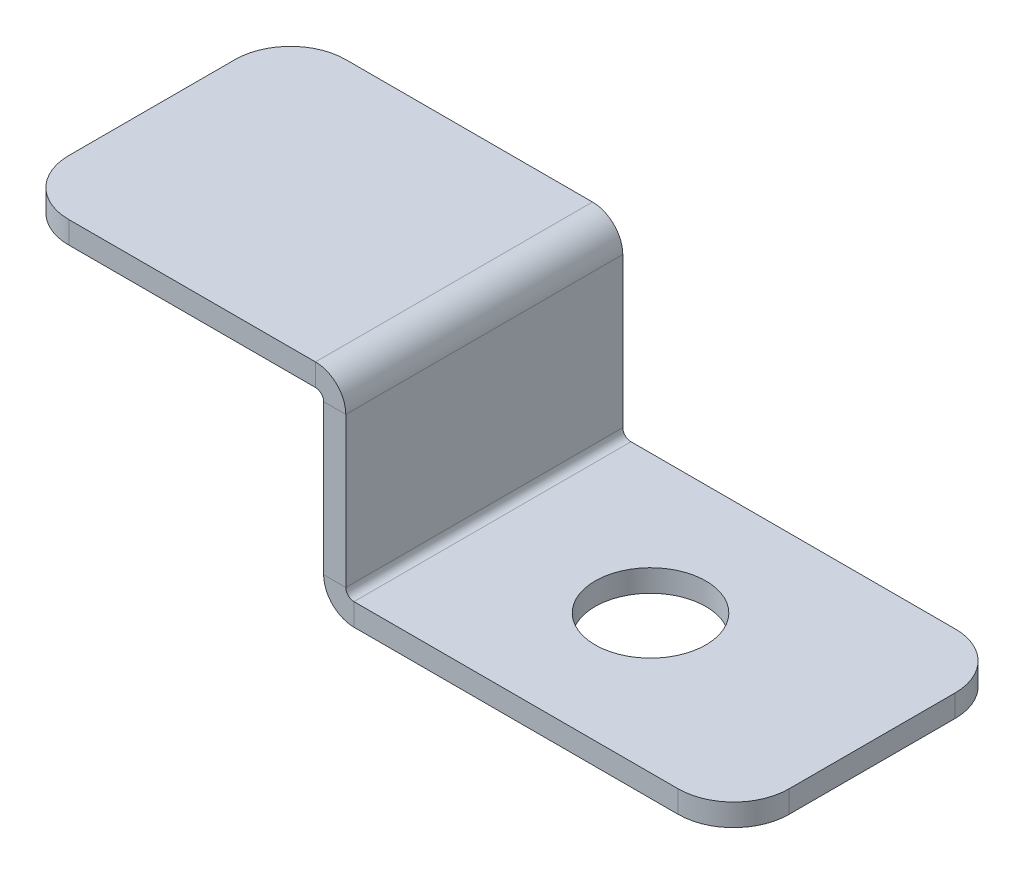
ISO-10303-21;
HEADER;
FILE_DESCRIPTION(('STEP AP214'),'2;1');
FILE_NAME('part.step','',(''),(''),'','','');
FILE_SCHEMA(('AUTOMOTIVE_DESIGN { 1 0 10303 214 1 1 1 1 }'));
ENDSEC;
DATA;
#1=APPLICATION_CONTEXT('core data for automotive mechanical design processes');
#2=APPLICATION_PROTOCOL_DEFINITION('international standard','automotive_design',2000,#1);
#3=PRODUCT_CONTEXT('',#1,'mechanical');
#4=PRODUCT('Part','Part','',(#3));
#5=PRODUCT_RELATED_PRODUCT_CATEGORY('part','',(#4));
#6=PRODUCT_DEFINITION_FORMATION('','',#4);
#7=PRODUCT_DEFINITION_CONTEXT('part definition',#1,'design');
#8=PRODUCT_DEFINITION('design','',#6,#7);
#9=PRODUCT_DEFINITION_SHAPE('','',#8);
#10=(LENGTH_UNIT() NAMED_UNIT(*) SI_UNIT(.MILLI.,.METRE.));
#11=(NAMED_UNIT(*) PLANE_ANGLE_UNIT() SI_UNIT($,.RADIAN.));
#12=(NAMED_UNIT(*) SI_UNIT($,.STERADIAN.) SOLID_ANGLE_UNIT());
#13=UNCERTAINTY_MEASURE_WITH_UNIT(LENGTH_MEASURE(1.E-05),#10,'distance_accuracy_value','');
#14=(GEOMETRIC_REPRESENTATION_CONTEXT(3) GLOBAL_UNCERTAINTY_ASSIGNED_CONTEXT((#13)) GLOBAL_UNIT_ASSIGNED_CONTEXT((#10,
#11,#12)) REPRESENTATION_CONTEXT('',''));
#15=CARTESIAN_POINT('',(0.,0.,0.));
#16=DIRECTION('',(0.,0.,1.));
#17=DIRECTION('',(1.,0.,0.));
#18=AXIS2_PLACEMENT_3D('',#15,#16,#17);
#19=CARTESIAN_POINT('',(30.,-2.7366,12.5));
#20=DIRECTION('',(0.,0.,1.));
#21=DIRECTION('',(1.,0.,0.));
#22=AXIS2_PLACEMENT_3D('',#19,#20,#21);
#23=PLANE('',#22);
#24=DIRECTION('',(-1.,0.,0.));
#25=VECTOR('',#24,1.);
#26=CARTESIAN_POINT('',(30.,-2.7366,12.5));
#27=LINE('',#26,#25);
#28=CARTESIAN_POINT('',(30.,-2.7366,12.5));
#29=VERTEX_POINT('',#28);
#30=CARTESIAN_POINT('',(28.,-2.7366,12.5));
#31=VERTEX_POINT('',#30);
#32=EDGE_CURVE('E272',#29,#31,#27,.T.);
#33=ORIENTED_EDGE('',*,*,#32,.F.);
#34=CARTESIAN_POINT('',(27.2634,-2.7366,12.5));
#35=DIRECTION('',(0.,0.,1.));
#36=DIRECTION('',(1.,0.,0.));
#37=AXIS2_PLACEMENT_3D('',#34,#35,#36);
#38=CIRCLE('',#37,2.7366);
#39=CARTESIAN_POINT('',(27.2634,0.,12.5));
#40=VERTEX_POINT('',#39);
#41=EDGE_CURVE('E188',#40,#29,#38,.F.);
#42=ORIENTED_EDGE('',*,*,#41,.F.);
#43=DIRECTION('',(0.,1.,0.));
#44=VECTOR('',#43,1.);
#45=CARTESIAN_POINT('',(27.2634,-2.,12.5));
#46=LINE('',#45,#44);
#47=CARTESIAN_POINT('',(27.2634,-2.,12.5));
#48=VERTEX_POINT('',#47);
#49=EDGE_CURVE('E269',#48,#40,#46,.T.);
#50=ORIENTED_EDGE('',*,*,#49,.F.);
#51=CARTESIAN_POINT('',(27.2634,-2.7366,12.5));
#52=DIRECTION('',(0.,0.,1.));
#53=DIRECTION('',(1.,0.,0.));
#54=AXIS2_PLACEMENT_3D('',#51,#52,#53);
#55=CIRCLE('',#54,0.7366);
#56=EDGE_CURVE('E198',#48,#31,#55,.F.);
#57=ORIENTED_EDGE('',*,*,#56,.T.);
#58=EDGE_LOOP('',(#33,#42,#50,#57));
#59=FACE_BOUND('',#58,.T.);
#60=ADVANCED_FACE('F39',(#59),#23,.T.);
#61=CARTESIAN_POINT('',(27.2634,-2.,12.5));
#62=DIRECTION('',(0.,0.,1.));
#63=DIRECTION('',(1.,0.,0.));
#64=AXIS2_PLACEMENT_3D('',#61,#62,#63);
#65=PLANE('',#64);
#66=DIRECTION('',(0.,-1.,0.));
#67=VECTOR('',#66,1.);
#68=CARTESIAN_POINT('',(30.,0.,12.5));
#69=LINE('',#68,#67);
#70=CARTESIAN_POINT('',(30.,-16.2634,12.5));
#71=VERTEX_POINT('',#70);
#72=EDGE_CURVE('E186',#29,#71,#69,.T.);
#73=ORIENTED_EDGE('',*,*,#72,.F.);
#74=ORIENTED_EDGE('',*,*,#32,.T.);
#75=DIRECTION('',(0.,1.,0.));
#76=VECTOR('',#75,1.);
#77=CARTESIAN_POINT('',(28.,0.,12.5));
#78=LINE('',#77,#76);
#79=CARTESIAN_POINT('',(28.,-16.2634,12.5));
#80=VERTEX_POINT('',#79);
#81=EDGE_CURVE('E201',#31,#80,#78,.F.);
#82=ORIENTED_EDGE('',*,*,#81,.T.);
#83=DIRECTION('',(1.,0.,0.));
#84=VECTOR('',#83,1.);
#85=CARTESIAN_POINT('',(28.,-16.2634,12.5));
#86=LINE('',#85,#84);
#87=EDGE_CURVE('E166',#80,#71,#86,.T.);
#88=ORIENTED_EDGE('',*,*,#87,.T.);
#89=EDGE_LOOP('',(#73,#74,#82,#88));
#90=FACE_BOUND('',#89,.T.);
#91=ADVANCED_FACE('F359',(#90),#65,.T.);
#92=CARTESIAN_POINT('',(27.2634,0.,-12.5));
#93=DIRECTION('',(0.,0.,-1.));
#94=DIRECTION('',(-1.,0.,0.));
#95=AXIS2_PLACEMENT_3D('',#92,#93,#94);
#96=PLANE('',#95);
#97=DIRECTION('',(0.,-1.,0.));
#98=VECTOR('',#97,1.);
#99=CARTESIAN_POINT('',(27.2634,0.,-12.5));
#100=LINE('',#99,#98);
#101=CARTESIAN_POINT('',(27.2634,0.,-12.5));
#102=VERTEX_POINT('',#101);
#103=CARTESIAN_POINT('',(27.2634,-2.,-12.5));
#104=VERTEX_POINT('',#103);
#105=EDGE_CURVE('E266',#102,#104,#100,.T.);
#106=ORIENTED_EDGE('',*,*,#105,.F.);
#107=CARTESIAN_POINT('',(27.2634,-2.7366,-12.5));
#108=DIRECTION('',(0.,0.,1.));
#109=DIRECTION('',(1.,0.,0.));
#110=AXIS2_PLACEMENT_3D('',#107,#108,#109);
#111=CIRCLE('',#110,2.7366);
#112=CARTESIAN_POINT('',(30.,-2.7366,-12.5));
#113=VERTEX_POINT('',#112);
#114=EDGE_CURVE('E216',#102,#113,#111,.F.);
#115=ORIENTED_EDGE('',*,*,#114,.T.);
#116=DIRECTION('',(1.,0.,0.));
#117=VECTOR('',#116,1.);
#118=CARTESIAN_POINT('',(28.,-2.7366,-12.5));
#119=LINE('',#118,#117);
#120=CARTESIAN_POINT('',(28.,-2.7366,-12.5));
#121=VERTEX_POINT('',#120);
#122=EDGE_CURVE('E165',#121,#113,#119,.T.);
#123=ORIENTED_EDGE('',*,*,#122,.F.);
#124=CARTESIAN_POINT('',(27.2634,-2.7366,-12.5));
#125=DIRECTION('',(0.,0.,1.));
#126=DIRECTION('',(1.,0.,0.));
#127=AXIS2_PLACEMENT_3D('',#124,#125,#126);
#128=CIRCLE('',#127,0.7366);
#129=EDGE_CURVE('E223',#104,#121,#128,.F.);
#130=ORIENTED_EDGE('',*,*,#129,.F.);
#131=EDGE_LOOP('',(#106,#115,#123,#130));
#132=FACE_BOUND('',#131,.T.);
#133=ADVANCED_FACE('F322',(#132),#96,.T.);
#134=CARTESIAN_POINT('',(28.,-2.7366,-12.5));
#135=DIRECTION('',(0.,0.,-1.));
#136=DIRECTION('',(-1.,0.,0.));
#137=AXIS2_PLACEMENT_3D('',#134,#135,#136);
#138=PLANE('',#137);
#139=DIRECTION('',(1.,0.,0.));
#140=VECTOR('',#139,1.);
#141=CARTESIAN_POINT('',(0.,-2.,-12.5));
#142=LINE('',#141,#140);
#143=CARTESIAN_POINT('',(5.,-2.,-12.5));
#144=VERTEX_POINT('',#143);
#145=EDGE_CURVE('E221',#144,#104,#142,.T.);
#146=ORIENTED_EDGE('',*,*,#145,.F.);
#147=DIRECTION('',(0.,1.,0.));
#148=VECTOR('',#147,1.);
#149=CARTESIAN_POINT('',(5.,-2.7366,-12.5));
#150=LINE('',#149,#148);
#151=CARTESIAN_POINT('',(5.,0.,-12.5));
#152=VERTEX_POINT('',#151);
#153=EDGE_CURVE('E47',#144,#152,#150,.T.);
#154=ORIENTED_EDGE('',*,*,#153,.T.);
#155=DIRECTION('',(1.,0.,0.));
#156=VECTOR('',#155,1.);
#157=CARTESIAN_POINT('',(0.,0.,-12.5));
#158=LINE('',#157,#156);
#159=EDGE_CURVE('E219',#152,#102,#158,.T.);
#160=ORIENTED_EDGE('',*,*,#159,.T.);
#161=ORIENTED_EDGE('',*,*,#105,.T.);
#162=EDGE_LOOP('',(#146,#154,#160,#161));
#163=FACE_BOUND('',#162,.T.);
#164=ADVANCED_FACE('F306',(#163),#138,.T.);
#165=CARTESIAN_POINT('',(30.7366,-17.,12.5));
#166=DIRECTION('',(0.,0.,1.));
#167=DIRECTION('',(1.,0.,0.));
#168=AXIS2_PLACEMENT_3D('',#165,#166,#167);
#169=PLANE('',#168);
#170=DIRECTION('',(0.,-1.,0.));
#171=VECTOR('',#170,1.);
#172=CARTESIAN_POINT('',(30.7366,-17.,12.5));
#173=LINE('',#172,#171);
#174=CARTESIAN_POINT('',(30.7366,-17.,12.5));
#175=VERTEX_POINT('',#174);
#176=CARTESIAN_POINT('',(30.7366,-19.,12.5));
#177=VERTEX_POINT('',#176);
#178=EDGE_CURVE('E156',#175,#177,#173,.T.);
#179=ORIENTED_EDGE('',*,*,#178,.F.);
#180=CARTESIAN_POINT('',(30.7366,-16.2634,12.5));
#181=DIRECTION('',(0.,0.,-1.));
#182=DIRECTION('',(-1.,0.,0.));
#183=AXIS2_PLACEMENT_3D('',#180,#181,#182);
#184=CIRCLE('',#183,0.7366);
#185=EDGE_CURVE('E160',#71,#175,#184,.F.);
#186=ORIENTED_EDGE('',*,*,#185,.F.);
#187=ORIENTED_EDGE('',*,*,#87,.F.);
#188=CARTESIAN_POINT('',(30.7366,-16.2634,12.5));
#189=DIRECTION('',(0.,0.,1.));
#190=DIRECTION('',(1.,0.,0.));
#191=AXIS2_PLACEMENT_3D('',#188,#189,#190);
#192=CIRCLE('',#191,2.7366);
#193=EDGE_CURVE('E163',#80,#177,#192,.T.);
#194=ORIENTED_EDGE('',*,*,#193,.T.);
#195=EDGE_LOOP('',(#179,#186,#187,#194));
#196=FACE_BOUND('',#195,.T.);
#197=ADVANCED_FACE('F158',(#196),#169,.T.);
#198=CARTESIAN_POINT('',(28.,-16.2634,12.5));
#199=DIRECTION('',(0.,0.,1.));
#200=DIRECTION('',(1.,0.,0.));
#201=AXIS2_PLACEMENT_3D('',#198,#199,#200);
#202=PLANE('',#201);
#203=DIRECTION('',(1.,0.,0.));
#204=VECTOR('',#203,1.);
#205=CARTESIAN_POINT('',(30.,-19.,12.5));
#206=LINE('',#205,#204);
#207=CARTESIAN_POINT('',(60.,-19.,12.5));
#208=VERTEX_POINT('',#207);
#209=EDGE_CURVE('E181',#177,#208,#206,.T.);
#210=ORIENTED_EDGE('',*,*,#209,.T.);
#211=DIRECTION('',(0.,-1.,0.));
#212=VECTOR('',#211,1.);
#213=CARTESIAN_POINT('',(60.,-16.2634,12.5));
#214=LINE('',#213,#212);
#215=CARTESIAN_POINT('',(60.,-17.,12.5));
#216=VERTEX_POINT('',#215);
#217=EDGE_CURVE('E62',#208,#216,#214,.F.);
#218=ORIENTED_EDGE('',*,*,#217,.T.);
#219=DIRECTION('',(1.,0.,0.));
#220=VECTOR('',#219,1.);
#221=CARTESIAN_POINT('',(30.,-17.,12.5));
#222=LINE('',#221,#220);
#223=EDGE_CURVE('E171',#175,#216,#222,.T.);
#224=ORIENTED_EDGE('',*,*,#223,.F.);
#225=ORIENTED_EDGE('',*,*,#178,.T.);
#226=EDGE_LOOP('',(#210,#218,#224,#225));
#227=FACE_BOUND('',#226,.T.);
#228=ADVANCED_FACE('F180',(#227),#202,.T.);
#229=CARTESIAN_POINT('',(30.,-16.2634,-12.5));
#230=DIRECTION('',(0.,0.,-1.));
#231=DIRECTION('',(-1.,0.,0.));
#232=AXIS2_PLACEMENT_3D('',#229,#230,#231);
#233=PLANE('',#232);
#234=DIRECTION('',(-1.,0.,0.));
#235=VECTOR('',#234,1.);
#236=CARTESIAN_POINT('',(30.,-16.2634,-12.5));
#237=LINE('',#236,#235);
#238=CARTESIAN_POINT('',(30.,-16.2634,-12.5));
#239=VERTEX_POINT('',#238);
#240=CARTESIAN_POINT('',(28.,-16.2634,-12.5));
#241=VERTEX_POINT('',#240);
#242=EDGE_CURVE('E262',#239,#241,#237,.T.);
#243=ORIENTED_EDGE('',*,*,#242,.F.);
#244=CARTESIAN_POINT('',(30.7366,-16.2634,-12.5));
#245=DIRECTION('',(0.,0.,-1.));
#246=DIRECTION('',(-1.,0.,0.));
#247=AXIS2_PLACEMENT_3D('',#244,#245,#246);
#248=CIRCLE('',#247,0.7366);
#249=CARTESIAN_POINT('',(30.7366,-17.,-12.5));
#250=VERTEX_POINT('',#249);
#251=EDGE_CURVE('E211',#239,#250,#248,.F.);
#252=ORIENTED_EDGE('',*,*,#251,.T.);
#253=DIRECTION('',(0.,1.,0.));
#254=VECTOR('',#253,1.);
#255=CARTESIAN_POINT('',(30.7366,-19.,-12.5));
#256=LINE('',#255,#254);
#257=CARTESIAN_POINT('',(30.7366,-19.,-12.5));
#258=VERTEX_POINT('',#257);
#259=EDGE_CURVE('E260',#258,#250,#256,.T.);
#260=ORIENTED_EDGE('',*,*,#259,.F.);
#261=CARTESIAN_POINT('',(30.7366,-16.2634,-12.5));
#262=DIRECTION('',(0.,0.,1.));
#263=DIRECTION('',(1.,0.,0.));
#264=AXIS2_PLACEMENT_3D('',#261,#262,#263);
#265=CIRCLE('',#264,2.7366);
#266=EDGE_CURVE('E229',#241,#258,#265,.T.);
#267=ORIENTED_EDGE('',*,*,#266,.F.);
#268=EDGE_LOOP('',(#243,#252,#260,#267));
#269=FACE_BOUND('',#268,.T.);
#270=ADVANCED_FACE('F375',(#269),#233,.T.);
#271=CARTESIAN_POINT('',(30.7366,-19.,-12.5));
#272=DIRECTION('',(0.,0.,-1.));
#273=DIRECTION('',(-1.,0.,0.));
#274=AXIS2_PLACEMENT_3D('',#271,#272,#273);
#275=PLANE('',#274);
#276=DIRECTION('',(0.,-1.,0.));
#277=VECTOR('',#276,1.);
#278=CARTESIAN_POINT('',(30.,0.,-12.5));
#279=LINE('',#278,#277);
#280=EDGE_CURVE('E213',#113,#239,#279,.T.);
#281=ORIENTED_EDGE('',*,*,#280,.T.);
#282=ORIENTED_EDGE('',*,*,#242,.T.);
#283=DIRECTION('',(0.,1.,0.));
#284=VECTOR('',#283,1.);
#285=CARTESIAN_POINT('',(28.,0.,-12.5));
#286=LINE('',#285,#284);
#287=EDGE_CURVE('E226',#121,#241,#286,.F.);
#288=ORIENTED_EDGE('',*,*,#287,.F.);
#289=ORIENTED_EDGE('',*,*,#122,.T.);
#290=EDGE_LOOP('',(#281,#282,#288,#289));
#291=FACE_BOUND('',#290,.T.);
#292=ADVANCED_FACE('F378',(#291),#275,.T.);
#293=CARTESIAN_POINT('',(30.,-19.,12.5));
#294=DIRECTION('',(0.,1.,0.));
#295=DIRECTION('',(0.,0.,1.));
#296=AXIS2_PLACEMENT_3D('',#293,#294,#295);
#297=PLANE('',#296);
#298=CARTESIAN_POINT('',(45.,-19.,0.));
#299=DIRECTION('',(0.,1.,0.));
#300=DIRECTION('',(0.,0.,1.));
#301=AXIS2_PLACEMENT_3D('',#298,#299,#300);
#302=CIRCLE('',#301,5.);
#303=CARTESIAN_POINT('',(45.,-19.,5.));
#304=VERTEX_POINT('',#303);
#305=EDGE_CURVE('E209',#304,#304,#302,.T.);
#306=ORIENTED_EDGE('',*,*,#305,.T.);
#307=EDGE_LOOP('',(#306));
#308=FACE_BOUND('',#307,.T.);
#309=DIRECTION('',(0.,0.,-1.));
#310=VECTOR('',#309,1.);
#311=CARTESIAN_POINT('',(65.,-19.,12.5));
#312=LINE('',#311,#310);
#313=CARTESIAN_POINT('',(65.,-19.,7.5));
#314=VERTEX_POINT('',#313);
#315=CARTESIAN_POINT('',(65.,-19.,-7.5));
#316=VERTEX_POINT('',#315);
#317=EDGE_CURVE('E257',#314,#316,#312,.T.);
#318=ORIENTED_EDGE('',*,*,#317,.F.);
#319=CARTESIAN_POINT('',(60.,-19.,7.5));
#320=DIRECTION('',(0.,1.,0.));
#321=DIRECTION('',(0.,0.,1.));
#322=AXIS2_PLACEMENT_3D('',#319,#320,#321);
#323=CIRCLE('',#322,5.);
#324=EDGE_CURVE('E296',#314,#208,#323,.F.);
#325=ORIENTED_EDGE('',*,*,#324,.T.);
#326=ORIENTED_EDGE('',*,*,#209,.F.);
#327=DIRECTION('',(0.,0.,-1.));
#328=VECTOR('',#327,1.);
#329=CARTESIAN_POINT('',(30.7366,-19.,12.5));
#330=LINE('',#329,#328);
#331=EDGE_CURVE('E205',#177,#258,#330,.T.);
#332=ORIENTED_EDGE('',*,*,#331,.T.);
#333=DIRECTION('',(1.,0.,0.));
#334=VECTOR('',#333,1.);
#335=CARTESIAN_POINT('',(30.,-19.,-12.5));
#336=LINE('',#335,#334);
#337=CARTESIAN_POINT('',(60.,-19.,-12.5));
#338=VERTEX_POINT('',#337);
#339=EDGE_CURVE('E206',#258,#338,#336,.T.);
#340=ORIENTED_EDGE('',*,*,#339,.T.);
#341=CARTESIAN_POINT('',(60.,-19.,-7.5));
#342=DIRECTION('',(0.,1.,0.));
#343=DIRECTION('',(0.,0.,1.));
#344=AXIS2_PLACEMENT_3D('',#341,#342,#343);
#345=CIRCLE('',#344,5.);
#346=EDGE_CURVE('E294',#338,#316,#345,.F.);
#347=ORIENTED_EDGE('',*,*,#346,.T.);
#348=EDGE_LOOP('',(#318,#325,#326,#332,#340,#347));
#349=FACE_BOUND('',#348,.T.);
#350=ADVANCED_FACE('F382',(#308,#349),#297,.F.);
#351=CARTESIAN_POINT('',(65.,-17.,12.5));
#352=DIRECTION('',(1.,0.,0.));
#353=DIRECTION('',(0.,0.,-1.));
#354=AXIS2_PLACEMENT_3D('',#351,#352,#353);
#355=PLANE('',#354);
#356=DIRECTION('',(0.,0.,-1.));
#357=VECTOR('',#356,1.);
#358=CARTESIAN_POINT('',(65.,-17.,12.5));
#359=LINE('',#358,#357);
#360=CARTESIAN_POINT('',(65.,-17.,7.5));
#361=VERTEX_POINT('',#360);
#362=CARTESIAN_POINT('',(65.,-17.,-7.5));
#363=VERTEX_POINT('',#362);
#364=EDGE_CURVE('E177',#361,#363,#359,.T.);
#365=ORIENTED_EDGE('',*,*,#364,.F.);
#366=DIRECTION('',(0.,-1.,0.));
#367=VECTOR('',#366,1.);
#368=CARTESIAN_POINT('',(65.,-17.,7.5));
#369=LINE('',#368,#367);
#370=EDGE_CURVE('E291',#361,#314,#369,.T.);
#371=ORIENTED_EDGE('',*,*,#370,.T.);
#372=ORIENTED_EDGE('',*,*,#317,.T.);
#373=DIRECTION('',(0.,-1.,0.));
#374=VECTOR('',#373,1.);
#375=CARTESIAN_POINT('',(65.,-17.,-7.5));
#376=LINE('',#375,#374);
#377=EDGE_CURVE('E289',#316,#363,#376,.F.);
#378=ORIENTED_EDGE('',*,*,#377,.T.);
#379=EDGE_LOOP('',(#365,#371,#372,#378));
#380=FACE_BOUND('',#379,.T.);
#381=ADVANCED_FACE('F386',(#380),#355,.T.);
#382=CARTESIAN_POINT('',(30.,-17.,12.5));
#383=DIRECTION('',(0.,1.,0.));
#384=DIRECTION('',(0.,0.,1.));
#385=AXIS2_PLACEMENT_3D('',#382,#383,#384);
#386=PLANE('',#385);
#387=CARTESIAN_POINT('',(45.,-17.,0.));
#388=DIRECTION('',(0.,1.,0.));
#389=DIRECTION('',(0.,0.,1.));
#390=AXIS2_PLACEMENT_3D('',#387,#388,#389);
#391=CIRCLE('',#390,5.);
#392=CARTESIAN_POINT('',(45.,-17.,5.));
#393=VERTEX_POINT('',#392);
#394=EDGE_CURVE('E430',#393,#393,#391,.T.);
#395=ORIENTED_EDGE('',*,*,#394,.F.);
#396=EDGE_LOOP('',(#395));
#397=FACE_BOUND('',#396,.T.);
#398=ORIENTED_EDGE('',*,*,#223,.T.);
#399=CARTESIAN_POINT('',(60.,-17.,7.5));
#400=DIRECTION('',(0.,1.,0.));
#401=DIRECTION('',(0.,0.,1.));
#402=AXIS2_PLACEMENT_3D('',#399,#400,#401);
#403=CIRCLE('',#402,5.);
#404=EDGE_CURVE('E300',#216,#361,#403,.T.);
#405=ORIENTED_EDGE('',*,*,#404,.T.);
#406=ORIENTED_EDGE('',*,*,#364,.T.);
#407=CARTESIAN_POINT('',(60.,-17.,-7.5));
#408=DIRECTION('',(0.,1.,0.));
#409=DIRECTION('',(0.,0.,1.));
#410=AXIS2_PLACEMENT_3D('',#407,#408,#409);
#411=CIRCLE('',#410,5.);
#412=CARTESIAN_POINT('',(60.,-17.,-12.5));
#413=VERTEX_POINT('',#412);
#414=EDGE_CURVE('E54',#363,#413,#411,.T.);
#415=ORIENTED_EDGE('',*,*,#414,.T.);
#416=DIRECTION('',(1.,0.,0.));
#417=VECTOR('',#416,1.);
#418=CARTESIAN_POINT('',(30.,-17.,-12.5));
#419=LINE('',#418,#417);
#420=EDGE_CURVE('E173',#250,#413,#419,.T.);
#421=ORIENTED_EDGE('',*,*,#420,.F.);
#422=DIRECTION('',(0.,0.,-1.));
#423=VECTOR('',#422,1.);
#424=CARTESIAN_POINT('',(30.7366,-17.,12.5));
#425=LINE('',#424,#423);
#426=EDGE_CURVE('E169',#175,#250,#425,.T.);
#427=ORIENTED_EDGE('',*,*,#426,.F.);
#428=EDGE_LOOP('',(#398,#405,#406,#415,#421,#427));
#429=FACE_BOUND('',#428,.T.);
#430=ADVANCED_FACE('F170',(#397,#429),#386,.T.);
#431=CARTESIAN_POINT('',(30.7366,-16.2634,12.5));
#432=DIRECTION('',(0.,0.,-1.));
#433=DIRECTION('',(-1.,0.,0.));
#434=AXIS2_PLACEMENT_3D('',#431,#432,#433);
#435=CYLINDRICAL_SURFACE('',#434,0.7366);
#436=ORIENTED_EDGE('',*,*,#251,.F.);
#437=DIRECTION('',(0.,0.,-1.));
#438=VECTOR('',#437,1.);
#439=CARTESIAN_POINT('',(30.,-16.2634,12.5));
#440=LINE('',#439,#438);
#441=EDGE_CURVE('E178',#71,#239,#440,.T.);
#442=ORIENTED_EDGE('',*,*,#441,.F.);
#443=ORIENTED_EDGE('',*,*,#185,.T.);
#444=ORIENTED_EDGE('',*,*,#426,.T.);
#445=EDGE_LOOP('',(#436,#442,#443,#444));
#446=FACE_BOUND('',#445,.T.);
#447=ADVANCED_FACE('F184',(#446),#435,.F.);
#448=CARTESIAN_POINT('',(30.,0.,12.5));
#449=DIRECTION('',(1.,0.,0.));
#450=DIRECTION('',(0.,0.,-1.));
#451=AXIS2_PLACEMENT_3D('',#448,#449,#450);
#452=PLANE('',#451);
#453=ORIENTED_EDGE('',*,*,#280,.F.);
#454=DIRECTION('',(0.,0.,-1.));
#455=VECTOR('',#454,1.);
#456=CARTESIAN_POINT('',(30.,-2.7366,12.5));
#457=LINE('',#456,#455);
#458=EDGE_CURVE('E252',#29,#113,#457,.T.);
#459=ORIENTED_EDGE('',*,*,#458,.F.);
#460=ORIENTED_EDGE('',*,*,#72,.T.);
#461=ORIENTED_EDGE('',*,*,#441,.T.);
#462=EDGE_LOOP('',(#453,#459,#460,#461));
#463=FACE_BOUND('',#462,.T.);
#464=ADVANCED_FACE('F396',(#463),#452,.T.);
#465=CARTESIAN_POINT('',(27.2634,-2.7366,12.5));
#466=DIRECTION('',(0.,0.,-1.));
#467=DIRECTION('',(-1.,0.,0.));
#468=AXIS2_PLACEMENT_3D('',#465,#466,#467);
#469=CYLINDRICAL_SURFACE('',#468,2.7366);
#470=ORIENTED_EDGE('',*,*,#114,.F.);
#471=DIRECTION('',(0.,0.,-1.));
#472=VECTOR('',#471,1.);
#473=CARTESIAN_POINT('',(27.2634,0.,12.5));
#474=LINE('',#473,#472);
#475=EDGE_CURVE('E249',#40,#102,#474,.T.);
#476=ORIENTED_EDGE('',*,*,#475,.F.);
#477=ORIENTED_EDGE('',*,*,#41,.T.);
#478=ORIENTED_EDGE('',*,*,#458,.T.);
#479=EDGE_LOOP('',(#470,#476,#477,#478));
#480=FACE_BOUND('',#479,.T.);
#481=ADVANCED_FACE('F318',(#480),#469,.T.);
#482=CARTESIAN_POINT('',(0.,0.,12.5));
#483=DIRECTION('',(0.,1.,0.));
#484=DIRECTION('',(0.,0.,1.));
#485=AXIS2_PLACEMENT_3D('',#482,#483,#484);
#486=PLANE('',#485);
#487=DIRECTION('',(0.,0.,-1.));
#488=VECTOR('',#487,1.);
#489=CARTESIAN_POINT('',(0.,0.,12.5));
#490=LINE('',#489,#488);
#491=CARTESIAN_POINT('',(0.,0.,7.5));
#492=VERTEX_POINT('',#491);
#493=CARTESIAN_POINT('',(0.,0.,-7.5));
#494=VERTEX_POINT('',#493);
#495=EDGE_CURVE('E246',#492,#494,#490,.T.);
#496=ORIENTED_EDGE('',*,*,#495,.F.);
#497=CARTESIAN_POINT('',(5.,0.,7.5));
#498=DIRECTION('',(0.,1.,0.));
#499=DIRECTION('',(0.,0.,1.));
#500=AXIS2_PLACEMENT_3D('',#497,#498,#499);
#501=CIRCLE('',#500,5.);
#502=CARTESIAN_POINT('',(5.,0.,12.5));
#503=VERTEX_POINT('',#502);
#504=EDGE_CURVE('E281',#492,#503,#501,.T.);
#505=ORIENTED_EDGE('',*,*,#504,.T.);
#506=DIRECTION('',(1.,0.,0.));
#507=VECTOR('',#506,1.);
#508=CARTESIAN_POINT('',(0.,0.,12.5));
#509=LINE('',#508,#507);
#510=EDGE_CURVE('E194',#503,#40,#509,.T.);
#511=ORIENTED_EDGE('',*,*,#510,.T.);
#512=ORIENTED_EDGE('',*,*,#475,.T.);
#513=ORIENTED_EDGE('',*,*,#159,.F.);
#514=CARTESIAN_POINT('',(5.,0.,-7.5));
#515=DIRECTION('',(0.,1.,0.));
#516=DIRECTION('',(0.,0.,1.));
#517=AXIS2_PLACEMENT_3D('',#514,#515,#516);
#518=CIRCLE('',#517,5.);
#519=EDGE_CURVE('E279',#152,#494,#518,.T.);
#520=ORIENTED_EDGE('',*,*,#519,.T.);
#521=EDGE_LOOP('',(#496,#505,#511,#512,#513,#520));
#522=FACE_BOUND('',#521,.T.);
#523=ADVANCED_FACE('F312',(#522),#486,.T.);
#524=CARTESIAN_POINT('',(0.,-2.,12.5));
#525=DIRECTION('',(-1.,0.,0.));
#526=DIRECTION('',(0.,0.,1.));
#527=AXIS2_PLACEMENT_3D('',#524,#525,#526);
#528=PLANE('',#527);
#529=DIRECTION('',(0.,0.,-1.));
#530=VECTOR('',#529,1.);
#531=CARTESIAN_POINT('',(0.,-2.,12.5));
#532=LINE('',#531,#530);
#533=CARTESIAN_POINT('',(0.,-2.,7.5));
#534=VERTEX_POINT('',#533);
#535=CARTESIAN_POINT('',(0.,-2.,-7.5));
#536=VERTEX_POINT('',#535);
#537=EDGE_CURVE('E243',#534,#536,#532,.T.);
#538=ORIENTED_EDGE('',*,*,#537,.F.);
#539=DIRECTION('',(0.,1.,0.));
#540=VECTOR('',#539,1.);
#541=CARTESIAN_POINT('',(0.,0.,7.5));
#542=LINE('',#541,#540);
#543=EDGE_CURVE('E276',#534,#492,#542,.T.);
#544=ORIENTED_EDGE('',*,*,#543,.T.);
#545=ORIENTED_EDGE('',*,*,#495,.T.);
#546=DIRECTION('',(0.,1.,0.));
#547=VECTOR('',#546,1.);
#548=CARTESIAN_POINT('',(0.,-2.,-7.5));
#549=LINE('',#548,#547);
#550=EDGE_CURVE('E274',#494,#536,#549,.F.);
#551=ORIENTED_EDGE('',*,*,#550,.T.);
#552=EDGE_LOOP('',(#538,#544,#545,#551));
#553=FACE_BOUND('',#552,.T.);
#554=ADVANCED_FACE('F337',(#553),#528,.T.);
#555=CARTESIAN_POINT('',(0.,-2.,12.5));
#556=DIRECTION('',(0.,1.,0.));
#557=DIRECTION('',(0.,0.,1.));
#558=AXIS2_PLACEMENT_3D('',#555,#556,#557);
#559=PLANE('',#558);
#560=DIRECTION('',(1.,0.,0.));
#561=VECTOR('',#560,1.);
#562=CARTESIAN_POINT('',(0.,-2.,12.5));
#563=LINE('',#562,#561);
#564=CARTESIAN_POINT('',(5.,-2.,12.5));
#565=VERTEX_POINT('',#564);
#566=EDGE_CURVE('E196',#565,#48,#563,.T.);
#567=ORIENTED_EDGE('',*,*,#566,.F.);
#568=CARTESIAN_POINT('',(5.,-2.,7.5));
#569=DIRECTION('',(0.,1.,0.));
#570=DIRECTION('',(0.,0.,1.));
#571=AXIS2_PLACEMENT_3D('',#568,#569,#570);
#572=CIRCLE('',#571,5.);
#573=EDGE_CURVE('E287',#565,#534,#572,.F.);
#574=ORIENTED_EDGE('',*,*,#573,.T.);
#575=ORIENTED_EDGE('',*,*,#537,.T.);
#576=CARTESIAN_POINT('',(5.,-2.,-7.5));
#577=DIRECTION('',(0.,1.,0.));
#578=DIRECTION('',(0.,0.,1.));
#579=AXIS2_PLACEMENT_3D('',#576,#577,#578);
#580=CIRCLE('',#579,5.);
#581=EDGE_CURVE('E285',#536,#144,#580,.F.);
#582=ORIENTED_EDGE('',*,*,#581,.T.);
#583=ORIENTED_EDGE('',*,*,#145,.T.);
#584=DIRECTION('',(0.,0.,-1.));
#585=VECTOR('',#584,1.);
#586=CARTESIAN_POINT('',(27.2634,-2.,12.5));
#587=LINE('',#586,#585);
#588=EDGE_CURVE('E240',#48,#104,#587,.T.);
#589=ORIENTED_EDGE('',*,*,#588,.F.);
#590=EDGE_LOOP('',(#567,#574,#575,#582,#583,#589));
#591=FACE_BOUND('',#590,.T.);
#592=ADVANCED_FACE('F331',(#591),#559,.F.);
#593=CARTESIAN_POINT('',(27.2634,-2.7366,12.5));
#594=DIRECTION('',(0.,0.,-1.));
#595=DIRECTION('',(-1.,0.,0.));
#596=AXIS2_PLACEMENT_3D('',#593,#594,#595);
#597=CYLINDRICAL_SURFACE('',#596,0.7366);
#598=ORIENTED_EDGE('',*,*,#129,.T.);
#599=DIRECTION('',(0.,0.,-1.));
#600=VECTOR('',#599,1.);
#601=CARTESIAN_POINT('',(28.,-2.7366,12.5));
#602=LINE('',#601,#600);
#603=EDGE_CURVE('E237',#31,#121,#602,.T.);
#604=ORIENTED_EDGE('',*,*,#603,.F.);
#605=ORIENTED_EDGE('',*,*,#56,.F.);
#606=ORIENTED_EDGE('',*,*,#588,.T.);
#607=EDGE_LOOP('',(#598,#604,#605,#606));
#608=FACE_BOUND('',#607,.T.);
#609=ADVANCED_FACE('F327',(#608),#597,.F.);
#610=CARTESIAN_POINT('',(28.,0.,12.5));
#611=DIRECTION('',(1.,0.,0.));
#612=DIRECTION('',(0.,0.,-1.));
#613=AXIS2_PLACEMENT_3D('',#610,#611,#612);
#614=PLANE('',#613);
#615=ORIENTED_EDGE('',*,*,#287,.T.);
#616=DIRECTION('',(0.,0.,-1.));
#617=VECTOR('',#616,1.);
#618=CARTESIAN_POINT('',(28.,-16.2634,12.5));
#619=LINE('',#618,#617);
#620=EDGE_CURVE('E234',#80,#241,#619,.T.);
#621=ORIENTED_EDGE('',*,*,#620,.F.);
#622=ORIENTED_EDGE('',*,*,#81,.F.);
#623=ORIENTED_EDGE('',*,*,#603,.T.);
#624=EDGE_LOOP('',(#615,#621,#622,#623));
#625=FACE_BOUND('',#624,.T.);
#626=ADVANCED_FACE('F410',(#625),#614,.F.);
#627=CARTESIAN_POINT('',(30.7366,-16.2634,12.5));
#628=DIRECTION('',(0.,0.,-1.));
#629=DIRECTION('',(-1.,0.,0.));
#630=AXIS2_PLACEMENT_3D('',#627,#628,#629);
#631=CYLINDRICAL_SURFACE('',#630,2.7366);
#632=ORIENTED_EDGE('',*,*,#266,.T.);
#633=ORIENTED_EDGE('',*,*,#331,.F.);
#634=ORIENTED_EDGE('',*,*,#193,.F.);
#635=ORIENTED_EDGE('',*,*,#620,.T.);
#636=EDGE_LOOP('',(#632,#633,#634,#635));
#637=FACE_BOUND('',#636,.T.);
#638=ADVANCED_FACE('F413',(#637),#631,.T.);
#639=CARTESIAN_POINT('',(30.7366,-16.2634,12.5));
#640=DIRECTION('',(0.,0.,-1.));
#641=DIRECTION('',(-1.,0.,0.));
#642=AXIS2_PLACEMENT_3D('',#639,#640,#641);
#643=PLANE('',#642);
#644=ORIENTED_EDGE('',*,*,#510,.F.);
#645=DIRECTION('',(0.,1.,0.));
#646=VECTOR('',#645,1.);
#647=CARTESIAN_POINT('',(5.,-2.,12.5));
#648=LINE('',#647,#646);
#649=EDGE_CURVE('E283',#503,#565,#648,.F.);
#650=ORIENTED_EDGE('',*,*,#649,.T.);
#651=ORIENTED_EDGE('',*,*,#566,.T.);
#652=ORIENTED_EDGE('',*,*,#49,.T.);
#653=EDGE_LOOP('',(#644,#650,#651,#652));
#654=FACE_BOUND('',#653,.T.);
#655=ADVANCED_FACE('F342',(#654),#643,.F.);
#656=CARTESIAN_POINT('',(30.7366,-16.2634,-12.5));
#657=DIRECTION('',(0.,0.,-1.));
#658=DIRECTION('',(-1.,0.,0.));
#659=AXIS2_PLACEMENT_3D('',#656,#657,#658);
#660=PLANE('',#659);
#661=ORIENTED_EDGE('',*,*,#420,.T.);
#662=DIRECTION('',(0.,-1.,0.));
#663=VECTOR('',#662,1.);
#664=CARTESIAN_POINT('',(60.,-16.2634,-12.5));
#665=LINE('',#664,#663);
#666=EDGE_CURVE('E11',#413,#338,#665,.T.);
#667=ORIENTED_EDGE('',*,*,#666,.T.);
#668=ORIENTED_EDGE('',*,*,#339,.F.);
#669=ORIENTED_EDGE('',*,*,#259,.T.);
#670=EDGE_LOOP('',(#661,#667,#668,#669));
#671=FACE_BOUND('',#670,.T.);
#672=ADVANCED_FACE('F347',(#671),#660,.T.);
#673=CARTESIAN_POINT('',(5.,-2.,7.5));
#674=DIRECTION('',(0.,-1.,0.));
#675=DIRECTION('',(0.,0.,-1.));
#676=AXIS2_PLACEMENT_3D('',#673,#674,#675);
#677=CYLINDRICAL_SURFACE('',#676,5.);
#678=ORIENTED_EDGE('',*,*,#573,.F.);
#679=ORIENTED_EDGE('',*,*,#649,.F.);
#680=ORIENTED_EDGE('',*,*,#504,.F.);
#681=ORIENTED_EDGE('',*,*,#543,.F.);
#682=EDGE_LOOP('',(#678,#679,#680,#681));
#683=FACE_BOUND('',#682,.T.);
#684=ADVANCED_FACE('F344',(#683),#677,.T.);
#685=CARTESIAN_POINT('',(60.,-17.,7.5));
#686=DIRECTION('',(0.,-1.,0.));
#687=DIRECTION('',(0.,0.,-1.));
#688=AXIS2_PLACEMENT_3D('',#685,#686,#687);
#689=CYLINDRICAL_SURFACE('',#688,5.);
#690=ORIENTED_EDGE('',*,*,#404,.F.);
#691=ORIENTED_EDGE('',*,*,#217,.F.);
#692=ORIENTED_EDGE('',*,*,#324,.F.);
#693=ORIENTED_EDGE('',*,*,#370,.F.);
#694=EDGE_LOOP('',(#690,#691,#692,#693));
#695=FACE_BOUND('',#694,.T.);
#696=ADVANCED_FACE('F346',(#695),#689,.T.);
#697=CARTESIAN_POINT('',(5.,-2.7366,-7.5));
#698=DIRECTION('',(0.,1.,0.));
#699=DIRECTION('',(0.,0.,1.));
#700=AXIS2_PLACEMENT_3D('',#697,#698,#699);
#701=CYLINDRICAL_SURFACE('',#700,5.);
#702=ORIENTED_EDGE('',*,*,#581,.F.);
#703=ORIENTED_EDGE('',*,*,#550,.F.);
#704=ORIENTED_EDGE('',*,*,#519,.F.);
#705=ORIENTED_EDGE('',*,*,#153,.F.);
#706=EDGE_LOOP('',(#702,#703,#704,#705));
#707=FACE_BOUND('',#706,.T.);
#708=ADVANCED_FACE('F335',(#707),#701,.T.);
#709=CARTESIAN_POINT('',(60.,-16.2634,-7.5));
#710=DIRECTION('',(0.,-1.,0.));
#711=DIRECTION('',(0.,0.,-1.));
#712=AXIS2_PLACEMENT_3D('',#709,#710,#711);
#713=CYLINDRICAL_SURFACE('',#712,5.);
#714=ORIENTED_EDGE('',*,*,#414,.F.);
#715=ORIENTED_EDGE('',*,*,#377,.F.);
#716=ORIENTED_EDGE('',*,*,#346,.F.);
#717=ORIENTED_EDGE('',*,*,#666,.F.);
#718=EDGE_LOOP('',(#714,#715,#716,#717));
#719=FACE_BOUND('',#718,.T.);
#720=ADVANCED_FACE('F41',(#719),#713,.T.);
#721=CARTESIAN_POINT('',(45.,-27.,0.));
#722=DIRECTION('',(0.,1.,0.));
#723=DIRECTION('',(0.,0.,1.));
#724=AXIS2_PLACEMENT_3D('',#721,#722,#723);
#725=CYLINDRICAL_SURFACE('',#724,5.);
#726=ORIENTED_EDGE('',*,*,#394,.T.);
#727=EDGE_LOOP('',(#726));
#728=FACE_BOUND('',#727,.T.);
#729=ORIENTED_EDGE('',*,*,#305,.F.);
#730=EDGE_LOOP('',(#729));
#731=FACE_BOUND('',#730,.T.);
#732=ADVANCED_FACE('F420',(#728,#731),#725,.F.);
#733=CLOSED_SHELL('',(#60,#91,#133,#164,#197,#228,#270,#292,#350,#381,#430,#447,#464,#481,#523,
#554,#592,#609,#626,#638,#655,#672,#684,#696,#708,#720,#732));
#734=MANIFOLD_SOLID_BREP('B2',#733);
#735=ADVANCED_BREP_SHAPE_REPRESENTATION('',(#18,#734),#14);
#736=SHAPE_DEFINITION_REPRESENTATION(#9,#735);
ENDSEC;
END-ISO-10303-21;
